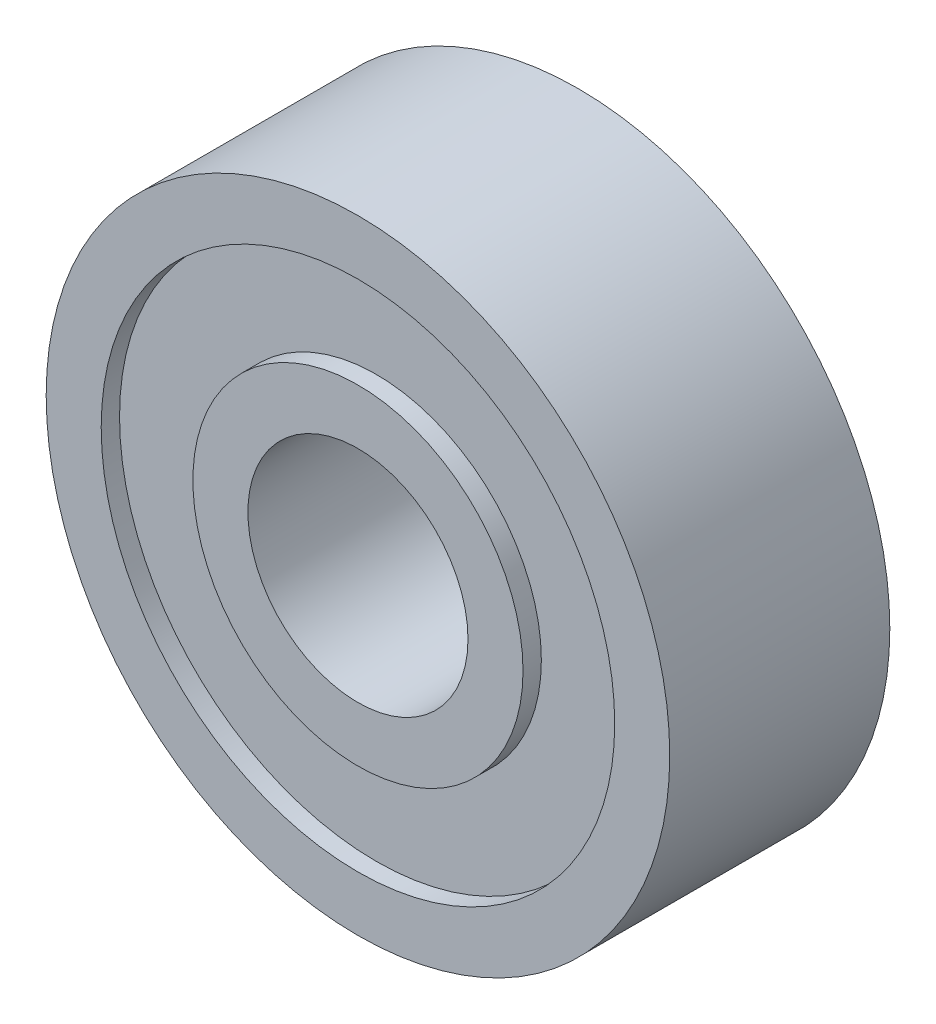
ISO-10303-21;
HEADER;
FILE_DESCRIPTION(('STEP AP214'),'2;1');
FILE_NAME('part.step','',(''),(''),'','','');
FILE_SCHEMA(('AUTOMOTIVE_DESIGN { 1 0 10303 214 1 1 1 1 }'));
ENDSEC;
DATA;
#1=APPLICATION_CONTEXT('core data for automotive mechanical design processes');
#2=APPLICATION_PROTOCOL_DEFINITION('international standard','automotive_design',2000,#1);
#3=PRODUCT_CONTEXT('',#1,'mechanical');
#4=PRODUCT('Part','Part','',(#3));
#5=PRODUCT_RELATED_PRODUCT_CATEGORY('part','',(#4));
#6=PRODUCT_DEFINITION_FORMATION('','',#4);
#7=PRODUCT_DEFINITION_CONTEXT('part definition',#1,'design');
#8=PRODUCT_DEFINITION('design','',#6,#7);
#9=PRODUCT_DEFINITION_SHAPE('','',#8);
#10=(LENGTH_UNIT() NAMED_UNIT(*) SI_UNIT(.MILLI.,.METRE.));
#11=(NAMED_UNIT(*) PLANE_ANGLE_UNIT() SI_UNIT($,.RADIAN.));
#12=(NAMED_UNIT(*) SI_UNIT($,.STERADIAN.) SOLID_ANGLE_UNIT());
#13=UNCERTAINTY_MEASURE_WITH_UNIT(LENGTH_MEASURE(1.E-05),#10,'distance_accuracy_value','');
#14=(GEOMETRIC_REPRESENTATION_CONTEXT(3) GLOBAL_UNCERTAINTY_ASSIGNED_CONTEXT((#13)) GLOBAL_UNIT_ASSIGNED_CONTEXT((#10,
#11,#12)) REPRESENTATION_CONTEXT('',''));
#15=CARTESIAN_POINT('',(0.,0.,0.));
#16=DIRECTION('',(0.,0.,1.));
#17=DIRECTION('',(1.,0.,0.));
#18=AXIS2_PLACEMENT_3D('',#15,#16,#17);
#19=CARTESIAN_POINT('',(0.,0.,-2.5));
#20=DIRECTION('',(0.,0.,1.));
#21=DIRECTION('',(0.,-1.,0.));
#22=AXIS2_PLACEMENT_3D('',#19,#20,#21);
#23=CYLINDRICAL_SURFACE('',#22,4.5);
#24=CARTESIAN_POINT('',(0.,0.,-3.));
#25=DIRECTION('',(0.,0.,1.));
#26=DIRECTION('',(0.,-1.,0.));
#27=AXIS2_PLACEMENT_3D('',#24,#25,#26);
#28=CIRCLE('',#27,4.5);
#29=CARTESIAN_POINT('',(0.,-4.5,-3.));
#30=VERTEX_POINT('',#29);
#31=EDGE_CURVE('E52',#30,#30,#28,.F.);
#32=ORIENTED_EDGE('',*,*,#31,.F.);
#33=EDGE_LOOP('',(#32));
#34=FACE_BOUND('',#33,.T.);
#35=CARTESIAN_POINT('',(0.,0.,-2.5));
#36=DIRECTION('',(0.,0.,1.));
#37=DIRECTION('',(0.,-1.,0.));
#38=AXIS2_PLACEMENT_3D('',#35,#36,#37);
#39=CIRCLE('',#38,4.5);
#40=CARTESIAN_POINT('',(0.,-4.5,-2.5));
#41=VERTEX_POINT('',#40);
#42=EDGE_CURVE('E18',#41,#41,#39,.T.);
#43=ORIENTED_EDGE('',*,*,#42,.F.);
#44=EDGE_LOOP('',(#43));
#45=FACE_BOUND('',#44,.T.);
#46=ADVANCED_FACE('F15',(#34,#45),#23,.T.);
#47=CARTESIAN_POINT('',(7.7,-7.7,-2.5));
#48=DIRECTION('',(0.,0.,-1.));
#49=DIRECTION('',(-1.,0.,0.));
#50=AXIS2_PLACEMENT_3D('',#47,#48,#49);
#51=PLANE('',#50);
#52=ORIENTED_EDGE('',*,*,#42,.T.);
#53=EDGE_LOOP('',(#52));
#54=FACE_BOUND('',#53,.T.);
#55=CARTESIAN_POINT('',(0.,0.,-2.5));
#56=DIRECTION('',(0.,0.,1.));
#57=DIRECTION('',(1.,0.,0.));
#58=AXIS2_PLACEMENT_3D('',#55,#56,#57);
#59=CIRCLE('',#58,7.);
#60=CARTESIAN_POINT('',(7.,0.,-2.5));
#61=VERTEX_POINT('',#60);
#62=EDGE_CURVE('E50',#61,#61,#59,.T.);
#63=ORIENTED_EDGE('',*,*,#62,.F.);
#64=EDGE_LOOP('',(#63));
#65=FACE_BOUND('',#64,.T.);
#66=ADVANCED_FACE('F59',(#54,#65),#51,.T.);
#67=CARTESIAN_POINT('',(4.95,-4.95,-3.));
#68=DIRECTION('',(0.,0.,-1.));
#69=DIRECTION('',(-1.,0.,0.));
#70=AXIS2_PLACEMENT_3D('',#67,#68,#69);
#71=PLANE('',#70);
#72=CARTESIAN_POINT('',(0.,0.,-3.));
#73=DIRECTION('',(0.,0.,1.));
#74=DIRECTION('',(1.,0.,0.));
#75=AXIS2_PLACEMENT_3D('',#72,#73,#74);
#76=CIRCLE('',#75,3.);
#77=CARTESIAN_POINT('',(3.,0.,-3.));
#78=VERTEX_POINT('',#77);
#79=EDGE_CURVE('E47',#78,#78,#76,.F.);
#80=ORIENTED_EDGE('',*,*,#79,.F.);
#81=EDGE_LOOP('',(#80));
#82=FACE_BOUND('',#81,.T.);
#83=ORIENTED_EDGE('',*,*,#31,.T.);
#84=EDGE_LOOP('',(#83));
#85=FACE_BOUND('',#84,.T.);
#86=ADVANCED_FACE('F68',(#82,#85),#71,.T.);
#87=CARTESIAN_POINT('',(0.,0.,-3.));
#88=DIRECTION('',(0.,0.,1.));
#89=DIRECTION('',(1.,0.,0.));
#90=AXIS2_PLACEMENT_3D('',#87,#88,#89);
#91=CYLINDRICAL_SURFACE('',#90,7.);
#92=ORIENTED_EDGE('',*,*,#62,.T.);
#93=EDGE_LOOP('',(#92));
#94=FACE_BOUND('',#93,.T.);
#95=CARTESIAN_POINT('',(0.,0.,-3.));
#96=DIRECTION('',(0.,0.,1.));
#97=DIRECTION('',(1.,0.,0.));
#98=AXIS2_PLACEMENT_3D('',#95,#96,#97);
#99=CIRCLE('',#98,7.);
#100=CARTESIAN_POINT('',(7.,0.,-3.));
#101=VERTEX_POINT('',#100);
#102=EDGE_CURVE('E44',#101,#101,#99,.T.);
#103=ORIENTED_EDGE('',*,*,#102,.F.);
#104=EDGE_LOOP('',(#103));
#105=FACE_BOUND('',#104,.T.);
#106=ADVANCED_FACE('F103',(#94,#105),#91,.F.);
#107=CARTESIAN_POINT('',(0.,0.,-3.));
#108=DIRECTION('',(0.,0.,1.));
#109=DIRECTION('',(1.,0.,0.));
#110=AXIS2_PLACEMENT_3D('',#107,#108,#109);
#111=CYLINDRICAL_SURFACE('',#110,3.);
#112=CARTESIAN_POINT('',(0.,0.,3.));
#113=DIRECTION('',(0.,0.,1.));
#114=DIRECTION('',(1.,0.,0.));
#115=AXIS2_PLACEMENT_3D('',#112,#113,#114);
#116=CIRCLE('',#115,3.);
#117=CARTESIAN_POINT('',(3.,0.,3.));
#118=VERTEX_POINT('',#117);
#119=EDGE_CURVE('E41',#118,#118,#116,.F.);
#120=ORIENTED_EDGE('',*,*,#119,.F.);
#121=EDGE_LOOP('',(#120));
#122=FACE_BOUND('',#121,.T.);
#123=ORIENTED_EDGE('',*,*,#79,.T.);
#124=EDGE_LOOP('',(#123));
#125=FACE_BOUND('',#124,.T.);
#126=ADVANCED_FACE('F99',(#122,#125),#111,.F.);
#127=CARTESIAN_POINT('',(9.35,-9.35,-3.));
#128=DIRECTION('',(0.,0.,-1.));
#129=DIRECTION('',(-1.,0.,0.));
#130=AXIS2_PLACEMENT_3D('',#127,#128,#129);
#131=PLANE('',#130);
#132=ORIENTED_EDGE('',*,*,#102,.T.);
#133=EDGE_LOOP('',(#132));
#134=FACE_BOUND('',#133,.T.);
#135=CARTESIAN_POINT('',(0.,0.,-3.));
#136=DIRECTION('',(0.,0.,1.));
#137=DIRECTION('',(1.,0.,0.));
#138=AXIS2_PLACEMENT_3D('',#135,#136,#137);
#139=CIRCLE('',#138,8.5);
#140=CARTESIAN_POINT('',(8.5,0.,-3.));
#141=VERTEX_POINT('',#140);
#142=EDGE_CURVE('E38',#141,#141,#139,.T.);
#143=ORIENTED_EDGE('',*,*,#142,.F.);
#144=EDGE_LOOP('',(#143));
#145=FACE_BOUND('',#144,.T.);
#146=ADVANCED_FACE('F95',(#134,#145),#131,.T.);
#147=CARTESIAN_POINT('',(-4.95,-4.95,3.));
#148=DIRECTION('',(0.,0.,1.));
#149=DIRECTION('',(1.,0.,0.));
#150=AXIS2_PLACEMENT_3D('',#147,#148,#149);
#151=PLANE('',#150);
#152=ORIENTED_EDGE('',*,*,#119,.T.);
#153=EDGE_LOOP('',(#152));
#154=FACE_BOUND('',#153,.T.);
#155=CARTESIAN_POINT('',(0.,0.,3.));
#156=DIRECTION('',(0.,0.,1.));
#157=DIRECTION('',(1.,0.,0.));
#158=AXIS2_PLACEMENT_3D('',#155,#156,#157);
#159=CIRCLE('',#158,4.5);
#160=CARTESIAN_POINT('',(4.5,0.,3.));
#161=VERTEX_POINT('',#160);
#162=EDGE_CURVE('E35',#161,#161,#159,.F.);
#163=ORIENTED_EDGE('',*,*,#162,.F.);
#164=EDGE_LOOP('',(#163));
#165=FACE_BOUND('',#164,.T.);
#166=ADVANCED_FACE('F91',(#154,#165),#151,.T.);
#167=CARTESIAN_POINT('',(0.,0.,3.));
#168=DIRECTION('',(0.,0.,1.));
#169=DIRECTION('',(1.,0.,0.));
#170=AXIS2_PLACEMENT_3D('',#167,#168,#169);
#171=CYLINDRICAL_SURFACE('',#170,8.5);
#172=CARTESIAN_POINT('',(0.,0.,3.));
#173=DIRECTION('',(0.,0.,1.));
#174=DIRECTION('',(1.,0.,0.));
#175=AXIS2_PLACEMENT_3D('',#172,#173,#174);
#176=CIRCLE('',#175,8.5);
#177=CARTESIAN_POINT('',(8.5,0.,3.));
#178=VERTEX_POINT('',#177);
#179=EDGE_CURVE('E32',#178,#178,#176,.T.);
#180=ORIENTED_EDGE('',*,*,#179,.F.);
#181=EDGE_LOOP('',(#180));
#182=FACE_BOUND('',#181,.T.);
#183=ORIENTED_EDGE('',*,*,#142,.T.);
#184=EDGE_LOOP('',(#183));
#185=FACE_BOUND('',#184,.T.);
#186=ADVANCED_FACE('F87',(#182,#185),#171,.T.);
#187=CARTESIAN_POINT('',(0.,0.,3.));
#188=DIRECTION('',(0.,0.,1.));
#189=DIRECTION('',(1.,0.,0.));
#190=AXIS2_PLACEMENT_3D('',#187,#188,#189);
#191=CYLINDRICAL_SURFACE('',#190,4.5);
#192=CARTESIAN_POINT('',(0.,0.,2.5));
#193=DIRECTION('',(0.,0.,1.));
#194=DIRECTION('',(1.,0.,0.));
#195=AXIS2_PLACEMENT_3D('',#192,#193,#194);
#196=CIRCLE('',#195,4.5);
#197=CARTESIAN_POINT('',(4.5,0.,2.5));
#198=VERTEX_POINT('',#197);
#199=EDGE_CURVE('E27',#198,#198,#196,.F.);
#200=ORIENTED_EDGE('',*,*,#199,.F.);
#201=EDGE_LOOP('',(#200));
#202=FACE_BOUND('',#201,.T.);
#203=ORIENTED_EDGE('',*,*,#162,.T.);
#204=EDGE_LOOP('',(#203));
#205=FACE_BOUND('',#204,.T.);
#206=ADVANCED_FACE('F83',(#202,#205),#191,.T.);
#207=CARTESIAN_POINT('',(-9.35,-9.35,3.));
#208=DIRECTION('',(0.,0.,1.));
#209=DIRECTION('',(1.,0.,0.));
#210=AXIS2_PLACEMENT_3D('',#207,#208,#209);
#211=PLANE('',#210);
#212=CARTESIAN_POINT('',(0.,0.,3.));
#213=DIRECTION('',(0.,0.,1.));
#214=DIRECTION('',(0.,-1.,0.));
#215=AXIS2_PLACEMENT_3D('',#212,#213,#214);
#216=CIRCLE('',#215,7.);
#217=CARTESIAN_POINT('',(0.,-7.,3.));
#218=VERTEX_POINT('',#217);
#219=EDGE_CURVE('E22',#218,#218,#216,.T.);
#220=ORIENTED_EDGE('',*,*,#219,.F.);
#221=EDGE_LOOP('',(#220));
#222=FACE_BOUND('',#221,.T.);
#223=ORIENTED_EDGE('',*,*,#179,.T.);
#224=EDGE_LOOP('',(#223));
#225=FACE_BOUND('',#224,.T.);
#226=ADVANCED_FACE('F76',(#222,#225),#211,.T.);
#227=CARTESIAN_POINT('',(-7.7,-7.7,2.5));
#228=DIRECTION('',(0.,0.,1.));
#229=DIRECTION('',(1.,0.,0.));
#230=AXIS2_PLACEMENT_3D('',#227,#228,#229);
#231=PLANE('',#230);
#232=ORIENTED_EDGE('',*,*,#199,.T.);
#233=EDGE_LOOP('',(#232));
#234=FACE_BOUND('',#233,.T.);
#235=CARTESIAN_POINT('',(0.,0.,2.5));
#236=DIRECTION('',(0.,0.,1.));
#237=DIRECTION('',(0.,-1.,0.));
#238=AXIS2_PLACEMENT_3D('',#235,#236,#237);
#239=CIRCLE('',#238,7.);
#240=CARTESIAN_POINT('',(0.,-7.,2.5));
#241=VERTEX_POINT('',#240);
#242=EDGE_CURVE('E10',#241,#241,#239,.F.);
#243=ORIENTED_EDGE('',*,*,#242,.F.);
#244=EDGE_LOOP('',(#243));
#245=FACE_BOUND('',#244,.T.);
#246=ADVANCED_FACE('F71',(#234,#245),#231,.T.);
#247=CARTESIAN_POINT('',(0.,0.,2.5));
#248=DIRECTION('',(0.,0.,1.));
#249=DIRECTION('',(0.,-1.,0.));
#250=AXIS2_PLACEMENT_3D('',#247,#248,#249);
#251=CYLINDRICAL_SURFACE('',#250,7.);
#252=ORIENTED_EDGE('',*,*,#242,.T.);
#253=EDGE_LOOP('',(#252));
#254=FACE_BOUND('',#253,.T.);
#255=ORIENTED_EDGE('',*,*,#219,.T.);
#256=EDGE_LOOP('',(#255));
#257=FACE_BOUND('',#256,.T.);
#258=ADVANCED_FACE('F69',(#254,#257),#251,.F.);
#259=CLOSED_SHELL('',(#46,#66,#86,#106,#126,#146,#166,#186,#206,#226,#246,#258));
#260=MANIFOLD_SOLID_BREP('B1',#259);
#261=ADVANCED_BREP_SHAPE_REPRESENTATION('',(#18,#260),#14);
#262=SHAPE_DEFINITION_REPRESENTATION(#9,#261);
ENDSEC;
END-ISO-10303-21;
